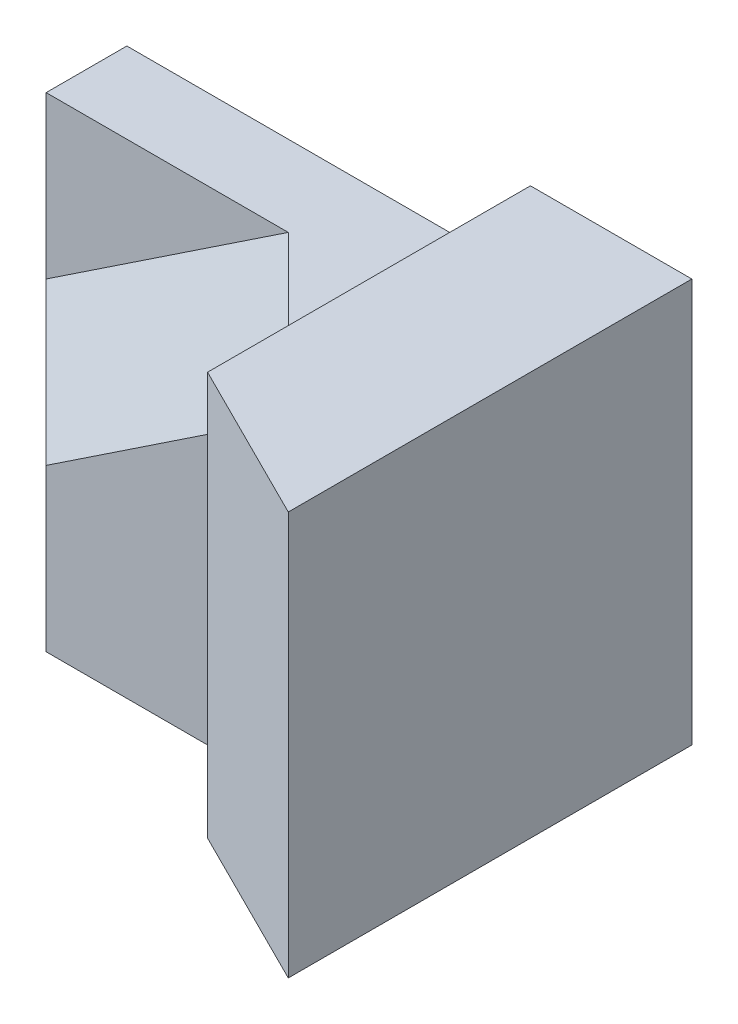
ISO-10303-21;
HEADER;
FILE_DESCRIPTION(('STEP AP214'),'2;1');
FILE_NAME('part.step','',(''),(''),'','','');
FILE_SCHEMA(('AUTOMOTIVE_DESIGN { 1 0 10303 214 1 1 1 1 }'));
ENDSEC;
DATA;
#1=APPLICATION_CONTEXT('core data for automotive mechanical design processes');
#2=APPLICATION_PROTOCOL_DEFINITION('international standard','automotive_design',2000,#1);
#3=PRODUCT_CONTEXT('',#1,'mechanical');
#4=PRODUCT('Part','Part','',(#3));
#5=PRODUCT_RELATED_PRODUCT_CATEGORY('part','',(#4));
#6=PRODUCT_DEFINITION_FORMATION('','',#4);
#7=PRODUCT_DEFINITION_CONTEXT('part definition',#1,'design');
#8=PRODUCT_DEFINITION('design','',#6,#7);
#9=PRODUCT_DEFINITION_SHAPE('','',#8);
#10=(LENGTH_UNIT() NAMED_UNIT(*) SI_UNIT(.MILLI.,.METRE.));
#11=(NAMED_UNIT(*) PLANE_ANGLE_UNIT() SI_UNIT($,.RADIAN.));
#12=(NAMED_UNIT(*) SI_UNIT($,.STERADIAN.) SOLID_ANGLE_UNIT());
#13=UNCERTAINTY_MEASURE_WITH_UNIT(LENGTH_MEASURE(1.E-05),#10,'distance_accuracy_value','');
#14=(GEOMETRIC_REPRESENTATION_CONTEXT(3) GLOBAL_UNCERTAINTY_ASSIGNED_CONTEXT((#13)) GLOBAL_UNIT_ASSIGNED_CONTEXT((#10,
#11,#12)) REPRESENTATION_CONTEXT('',''));
#15=CARTESIAN_POINT('',(0.,0.,0.));
#16=DIRECTION('',(0.,0.,1.));
#17=DIRECTION('',(1.,0.,0.));
#18=AXIS2_PLACEMENT_3D('',#15,#16,#17);
#19=CARTESIAN_POINT('',(0.,0.,10.));
#20=DIRECTION('',(0.,0.,1.));
#21=DIRECTION('',(1.,0.,0.));
#22=AXIS2_PLACEMENT_3D('',#19,#20,#21);
#23=PLANE('',#22);
#24=DIRECTION('',(1.,0.,0.));
#25=VECTOR('',#24,1.);
#26=CARTESIAN_POINT('',(0.,20.,10.));
#27=LINE('',#26,#25);
#28=CARTESIAN_POINT('',(0.,20.,10.));
#29=VERTEX_POINT('',#28);
#30=CARTESIAN_POINT('',(20.,20.,10.));
#31=VERTEX_POINT('',#30);
#32=EDGE_CURVE('E201',#29,#31,#27,.T.);
#33=ORIENTED_EDGE('',*,*,#32,.F.);
#34=DIRECTION('',(0.,-1.,0.));
#35=VECTOR('',#34,1.);
#36=CARTESIAN_POINT('',(0.,40.,10.));
#37=LINE('',#36,#35);
#38=CARTESIAN_POINT('',(0.,0.,10.));
#39=VERTEX_POINT('',#38);
#40=EDGE_CURVE('E152',#29,#39,#37,.T.);
#41=ORIENTED_EDGE('',*,*,#40,.T.);
#42=DIRECTION('',(1.,0.,0.));
#43=VECTOR('',#42,1.);
#44=CARTESIAN_POINT('',(0.,0.,10.));
#45=LINE('',#44,#43);
#46=CARTESIAN_POINT('',(20.,0.,10.));
#47=VERTEX_POINT('',#46);
#48=EDGE_CURVE('E157',#39,#47,#45,.T.);
#49=ORIENTED_EDGE('',*,*,#48,.T.);
#50=DIRECTION('',(0.,-1.,0.));
#51=VECTOR('',#50,1.);
#52=CARTESIAN_POINT('',(20.,19.99999999975,10.));
#53=LINE('',#52,#51);
#54=EDGE_CURVE('E182',#31,#47,#53,.T.);
#55=ORIENTED_EDGE('',*,*,#54,.F.);
#56=EDGE_LOOP('',(#33,#41,#49,#55));
#57=FACE_BOUND('',#56,.T.);
#58=ADVANCED_FACE('F33',(#57),#23,.T.);
#59=CARTESIAN_POINT('',(50.,50.,0.));
#60=DIRECTION('',(1.,0.,0.));
#61=DIRECTION('',(0.,0.,-1.));
#62=AXIS2_PLACEMENT_3D('',#59,#60,#61);
#63=PLANE('',#62);
#64=DIRECTION('',(0.,0.,1.));
#65=VECTOR('',#64,1.);
#66=CARTESIAN_POINT('',(50.,0.,10.));
#67=LINE('',#66,#65);
#68=CARTESIAN_POINT('',(50.,0.,30.));
#69=VERTEX_POINT('',#68);
#70=CARTESIAN_POINT('',(50.,0.,40.));
#71=VERTEX_POINT('',#70);
#72=EDGE_CURVE('E122',#69,#71,#67,.T.);
#73=ORIENTED_EDGE('',*,*,#72,.T.);
#74=DIRECTION('',(0.,1.,0.));
#75=VECTOR('',#74,1.);
#76=CARTESIAN_POINT('',(50.,-18.,40.));
#77=LINE('',#76,#75);
#78=CARTESIAN_POINT('',(50.,50.,40.));
#79=VERTEX_POINT('',#78);
#80=EDGE_CURVE('E132',#71,#79,#77,.T.);
#81=ORIENTED_EDGE('',*,*,#80,.T.);
#82=DIRECTION('',(0.,0.,1.));
#83=VECTOR('',#82,1.);
#84=CARTESIAN_POINT('',(50.,50.,0.));
#85=LINE('',#84,#83);
#86=CARTESIAN_POINT('',(50.,50.,0.));
#87=VERTEX_POINT('',#86);
#88=EDGE_CURVE('E131',#87,#79,#85,.T.);
#89=ORIENTED_EDGE('',*,*,#88,.F.);
#90=DIRECTION('',(0.,1.,0.));
#91=VECTOR('',#90,1.);
#92=CARTESIAN_POINT('',(50.,50.,0.));
#93=LINE('',#92,#91);
#94=CARTESIAN_POINT('',(50.,40.,0.));
#95=VERTEX_POINT('',#94);
#96=EDGE_CURVE('E149',#95,#87,#93,.T.);
#97=ORIENTED_EDGE('',*,*,#96,.F.);
#98=DIRECTION('',(0.,0.,-1.));
#99=VECTOR('',#98,1.);
#100=CARTESIAN_POINT('',(50.,40.,10.));
#101=LINE('',#100,#99);
#102=CARTESIAN_POINT('',(50.,40.,30.));
#103=VERTEX_POINT('',#102);
#104=EDGE_CURVE('E156',#103,#95,#101,.T.);
#105=ORIENTED_EDGE('',*,*,#104,.F.);
#106=DIRECTION('',(0.,1.,0.));
#107=VECTOR('',#106,1.);
#108=CARTESIAN_POINT('',(50.,0.,30.));
#109=LINE('',#108,#107);
#110=EDGE_CURVE('E184',#69,#103,#109,.T.);
#111=ORIENTED_EDGE('',*,*,#110,.F.);
#112=EDGE_LOOP('',(#73,#81,#89,#97,#105,#111));
#113=FACE_BOUND('',#112,.T.);
#114=ADVANCED_FACE('F209',(#113),#63,.F.);
#115=CARTESIAN_POINT('',(0.,0.,50.));
#116=DIRECTION('',(0.,1.,0.));
#117=DIRECTION('',(0.,0.,1.));
#118=AXIS2_PLACEMENT_3D('',#115,#116,#117);
#119=PLANE('',#118);
#120=DIRECTION('',(0.,0.,-1.));
#121=VECTOR('',#120,1.);
#122=CARTESIAN_POINT('',(70.,0.,50.));
#123=LINE('',#122,#121);
#124=CARTESIAN_POINT('',(70.,0.,50.));
#125=VERTEX_POINT('',#124);
#126=CARTESIAN_POINT('',(70.,0.,0.));
#127=VERTEX_POINT('',#126);
#128=EDGE_CURVE('E142',#125,#127,#123,.T.);
#129=ORIENTED_EDGE('',*,*,#128,.F.);
#130=DIRECTION('',(-0.894427190999916,0.,-0.447213595499958));
#131=VECTOR('',#130,1.);
#132=CARTESIAN_POINT('',(14.,0.,22.));
#133=LINE('',#132,#131);
#134=EDGE_CURVE('E117',#125,#71,#133,.T.);
#135=ORIENTED_EDGE('',*,*,#134,.T.);
#136=ORIENTED_EDGE('',*,*,#72,.F.);
#137=DIRECTION('',(1.,0.,0.));
#138=VECTOR('',#137,1.);
#139=CARTESIAN_POINT('',(20.,0.,30.));
#140=LINE('',#139,#138);
#141=CARTESIAN_POINT('',(20.,0.,30.));
#142=VERTEX_POINT('',#141);
#143=EDGE_CURVE('E181',#142,#69,#140,.T.);
#144=ORIENTED_EDGE('',*,*,#143,.F.);
#145=DIRECTION('',(0.,0.,-1.));
#146=VECTOR('',#145,1.);
#147=CARTESIAN_POINT('',(20.,0.,30.));
#148=LINE('',#147,#146);
#149=EDGE_CURVE('E153',#142,#47,#148,.T.);
#150=ORIENTED_EDGE('',*,*,#149,.T.);
#151=ORIENTED_EDGE('',*,*,#48,.F.);
#152=DIRECTION('',(0.,0.,-1.));
#153=VECTOR('',#152,1.);
#154=CARTESIAN_POINT('',(0.,0.,50.));
#155=LINE('',#154,#153);
#156=CARTESIAN_POINT('',(0.,0.,0.));
#157=VERTEX_POINT('',#156);
#158=EDGE_CURVE('E147',#39,#157,#155,.T.);
#159=ORIENTED_EDGE('',*,*,#158,.T.);
#160=DIRECTION('',(1.,0.,0.));
#161=VECTOR('',#160,1.);
#162=CARTESIAN_POINT('',(0.,0.,0.));
#163=LINE('',#162,#161);
#164=EDGE_CURVE('E146',#157,#127,#163,.T.);
#165=ORIENTED_EDGE('',*,*,#164,.T.);
#166=EDGE_LOOP('',(#129,#135,#136,#144,#150,#151,#159,#165));
#167=FACE_BOUND('',#166,.T.);
#168=ADVANCED_FACE('F176',(#167),#119,.F.);
#169=CARTESIAN_POINT('',(70.,0.,50.));
#170=DIRECTION('',(-1.,0.,0.));
#171=DIRECTION('',(0.,0.,1.));
#172=AXIS2_PLACEMENT_3D('',#169,#170,#171);
#173=PLANE('',#172);
#174=DIRECTION('',(0.,1.,0.));
#175=VECTOR('',#174,1.);
#176=CARTESIAN_POINT('',(70.,0.,0.));
#177=LINE('',#176,#175);
#178=CARTESIAN_POINT('',(70.,50.,0.));
#179=VERTEX_POINT('',#178);
#180=EDGE_CURVE('E136',#127,#179,#177,.T.);
#181=ORIENTED_EDGE('',*,*,#180,.T.);
#182=DIRECTION('',(0.,0.,-1.));
#183=VECTOR('',#182,1.);
#184=CARTESIAN_POINT('',(70.,50.,50.));
#185=LINE('',#184,#183);
#186=CARTESIAN_POINT('',(70.,50.,50.));
#187=VERTEX_POINT('',#186);
#188=EDGE_CURVE('E123',#187,#179,#185,.T.);
#189=ORIENTED_EDGE('',*,*,#188,.F.);
#190=DIRECTION('',(0.,1.,0.));
#191=VECTOR('',#190,1.);
#192=CARTESIAN_POINT('',(70.,0.,50.));
#193=LINE('',#192,#191);
#194=EDGE_CURVE('E111',#125,#187,#193,.T.);
#195=ORIENTED_EDGE('',*,*,#194,.F.);
#196=ORIENTED_EDGE('',*,*,#128,.T.);
#197=EDGE_LOOP('',(#181,#189,#195,#196));
#198=FACE_BOUND('',#197,.T.);
#199=ADVANCED_FACE('F134',(#198),#173,.F.);
#200=CARTESIAN_POINT('',(0.,50.,50.));
#201=DIRECTION('',(0.,-1.,0.));
#202=DIRECTION('',(0.,0.,-1.));
#203=AXIS2_PLACEMENT_3D('',#200,#201,#202);
#204=PLANE('',#203);
#205=ORIENTED_EDGE('',*,*,#88,.T.);
#206=DIRECTION('',(-0.894427190999916,0.,-0.447213595499958));
#207=VECTOR('',#206,1.);
#208=CARTESIAN_POINT('',(70.,50.,50.));
#209=LINE('',#208,#207);
#210=EDGE_CURVE('E114',#187,#79,#209,.T.);
#211=ORIENTED_EDGE('',*,*,#210,.F.);
#212=ORIENTED_EDGE('',*,*,#188,.T.);
#213=DIRECTION('',(-1.,0.,0.));
#214=VECTOR('',#213,1.);
#215=CARTESIAN_POINT('',(0.,50.,0.));
#216=LINE('',#215,#214);
#217=EDGE_CURVE('E138',#179,#87,#216,.T.);
#218=ORIENTED_EDGE('',*,*,#217,.T.);
#219=EDGE_LOOP('',(#205,#211,#212,#218));
#220=FACE_BOUND('',#219,.T.);
#221=ADVANCED_FACE('F128',(#220),#204,.F.);
#222=CARTESIAN_POINT('',(20.,19.99999999975,30.));
#223=DIRECTION('',(1.,0.,0.));
#224=DIRECTION('',(0.,0.,-1.));
#225=AXIS2_PLACEMENT_3D('',#222,#223,#224);
#226=PLANE('',#225);
#227=DIRECTION('',(0.,-1.,0.));
#228=VECTOR('',#227,1.);
#229=CARTESIAN_POINT('',(20.,19.99999999975,30.));
#230=LINE('',#229,#228);
#231=CARTESIAN_POINT('',(20.,19.99999999975,30.));
#232=VERTEX_POINT('',#231);
#233=EDGE_CURVE('E187',#232,#142,#230,.T.);
#234=ORIENTED_EDGE('',*,*,#233,.F.);
#235=DIRECTION('',(0.,0.,-1.));
#236=VECTOR('',#235,1.);
#237=CARTESIAN_POINT('',(20.,20.,30.));
#238=LINE('',#237,#236);
#239=EDGE_CURVE('E204',#232,#31,#238,.T.);
#240=ORIENTED_EDGE('',*,*,#239,.T.);
#241=ORIENTED_EDGE('',*,*,#54,.T.);
#242=ORIENTED_EDGE('',*,*,#149,.F.);
#243=EDGE_LOOP('',(#234,#240,#241,#242));
#244=FACE_BOUND('',#243,.T.);
#245=ADVANCED_FACE('F222',(#244),#226,.F.);
#246=CARTESIAN_POINT('',(0.,0.,30.));
#247=DIRECTION('',(0.,0.,-1.));
#248=DIRECTION('',(-1.,0.,0.));
#249=AXIS2_PLACEMENT_3D('',#246,#247,#248);
#250=PLANE('',#249);
#251=ORIENTED_EDGE('',*,*,#110,.T.);
#252=DIRECTION('',(-0.832050294334644,-0.554700196230029,0.));
#253=VECTOR('',#252,1.);
#254=CARTESIAN_POINT('',(50.,40.,30.));
#255=LINE('',#254,#253);
#256=EDGE_CURVE('E189',#103,#232,#255,.T.);
#257=ORIENTED_EDGE('',*,*,#256,.T.);
#258=ORIENTED_EDGE('',*,*,#233,.T.);
#259=ORIENTED_EDGE('',*,*,#143,.T.);
#260=EDGE_LOOP('',(#251,#257,#258,#259));
#261=FACE_BOUND('',#260,.T.);
#262=ADVANCED_FACE('F215',(#261),#250,.F.);
#263=CARTESIAN_POINT('',(-9.41176470583046,14.1176470585692,9.41176470583046));
#264=DIRECTION('',(0.485071250075876,-0.727606875104719,-0.485071250075876));
#265=DIRECTION('',(0.,0.55470019623003,-0.832050294334644));
#266=AXIS2_PLACEMENT_3D('',#263,#264,#265);
#267=PLANE('',#266);
#268=DIRECTION('',(-0.832050294334644,-0.554700196230029,0.));
#269=VECTOR('',#268,1.);
#270=CARTESIAN_POINT('',(0.,19.99999999975,10.));
#271=LINE('',#270,#269);
#272=CARTESIAN_POINT('',(30.,40.,10.));
#273=VERTEX_POINT('',#272);
#274=EDGE_CURVE('E198',#273,#29,#271,.T.);
#275=ORIENTED_EDGE('',*,*,#274,.T.);
#276=DIRECTION('',(0.707106781186547,0.,0.707106781186548));
#277=VECTOR('',#276,1.);
#278=CARTESIAN_POINT('',(20.,19.99999999975,30.));
#279=LINE('',#278,#277);
#280=EDGE_CURVE('E195',#29,#232,#279,.T.);
#281=ORIENTED_EDGE('',*,*,#280,.T.);
#282=ORIENTED_EDGE('',*,*,#256,.F.);
#283=DIRECTION('',(-0.707106781186548,0.,-0.707106781186548));
#284=VECTOR('',#283,1.);
#285=CARTESIAN_POINT('',(30.,40.,10.));
#286=LINE('',#285,#284);
#287=EDGE_CURVE('E185',#103,#273,#286,.T.);
#288=ORIENTED_EDGE('',*,*,#287,.T.);
#289=EDGE_LOOP('',(#275,#281,#282,#288));
#290=FACE_BOUND('',#289,.T.);
#291=ADVANCED_FACE('F220',(#290),#267,.F.);
#292=CARTESIAN_POINT('',(0.,20.,30.));
#293=DIRECTION('',(0.,-1.,0.));
#294=DIRECTION('',(0.,0.,-1.));
#295=AXIS2_PLACEMENT_3D('',#292,#293,#294);
#296=PLANE('',#295);
#297=ORIENTED_EDGE('',*,*,#280,.F.);
#298=ORIENTED_EDGE('',*,*,#32,.T.);
#299=ORIENTED_EDGE('',*,*,#239,.F.);
#300=EDGE_LOOP('',(#297,#298,#299));
#301=FACE_BOUND('',#300,.T.);
#302=ADVANCED_FACE('F227',(#301),#296,.T.);
#303=CARTESIAN_POINT('',(0.,0.,10.));
#304=DIRECTION('',(0.,0.,1.));
#305=DIRECTION('',(1.,0.,0.));
#306=AXIS2_PLACEMENT_3D('',#303,#304,#305);
#307=PLANE('',#306);
#308=DIRECTION('',(0.,-1.,0.));
#309=VECTOR('',#308,1.);
#310=CARTESIAN_POINT('',(0.,40.,10.));
#311=LINE('',#310,#309);
#312=CARTESIAN_POINT('',(0.,40.,10.));
#313=VERTEX_POINT('',#312);
#314=EDGE_CURVE('E162',#313,#29,#311,.T.);
#315=ORIENTED_EDGE('',*,*,#314,.T.);
#316=ORIENTED_EDGE('',*,*,#274,.F.);
#317=DIRECTION('',(-1.,0.,0.));
#318=VECTOR('',#317,1.);
#319=CARTESIAN_POINT('',(0.,40.,10.));
#320=LINE('',#319,#318);
#321=EDGE_CURVE('E56',#273,#313,#320,.T.);
#322=ORIENTED_EDGE('',*,*,#321,.T.);
#323=EDGE_LOOP('',(#315,#316,#322));
#324=FACE_BOUND('',#323,.T.);
#325=ADVANCED_FACE('F225',(#324),#307,.T.);
#326=CARTESIAN_POINT('',(0.,0.,0.));
#327=DIRECTION('',(0.,0.,-1.));
#328=DIRECTION('',(-1.,0.,0.));
#329=AXIS2_PLACEMENT_3D('',#326,#327,#328);
#330=PLANE('',#329);
#331=ORIENTED_EDGE('',*,*,#164,.F.);
#332=DIRECTION('',(0.,-1.,0.));
#333=VECTOR('',#332,1.);
#334=CARTESIAN_POINT('',(0.,0.,0.));
#335=LINE('',#334,#333);
#336=CARTESIAN_POINT('',(0.,40.,0.));
#337=VERTEX_POINT('',#336);
#338=EDGE_CURVE('E11',#337,#157,#335,.T.);
#339=ORIENTED_EDGE('',*,*,#338,.F.);
#340=DIRECTION('',(1.,0.,0.));
#341=VECTOR('',#340,1.);
#342=CARTESIAN_POINT('',(0.,40.,0.));
#343=LINE('',#342,#341);
#344=EDGE_CURVE('E48',#337,#95,#343,.T.);
#345=ORIENTED_EDGE('',*,*,#344,.T.);
#346=ORIENTED_EDGE('',*,*,#96,.T.);
#347=ORIENTED_EDGE('',*,*,#217,.F.);
#348=ORIENTED_EDGE('',*,*,#180,.F.);
#349=EDGE_LOOP('',(#331,#339,#345,#346,#347,#348));
#350=FACE_BOUND('',#349,.T.);
#351=ADVANCED_FACE('F174',(#350),#330,.T.);
#352=CARTESIAN_POINT('',(0.,40.,0.));
#353=DIRECTION('',(0.,-1.,0.));
#354=DIRECTION('',(0.,0.,-1.));
#355=AXIS2_PLACEMENT_3D('',#352,#353,#354);
#356=PLANE('',#355);
#357=ORIENTED_EDGE('',*,*,#321,.F.);
#358=ORIENTED_EDGE('',*,*,#287,.F.);
#359=ORIENTED_EDGE('',*,*,#104,.T.);
#360=ORIENTED_EDGE('',*,*,#344,.F.);
#361=DIRECTION('',(0.,0.,1.));
#362=VECTOR('',#361,1.);
#363=CARTESIAN_POINT('',(0.,40.,0.));
#364=LINE('',#363,#362);
#365=EDGE_CURVE('E41',#337,#313,#364,.T.);
#366=ORIENTED_EDGE('',*,*,#365,.T.);
#367=EDGE_LOOP('',(#357,#358,#359,#360,#366));
#368=FACE_BOUND('',#367,.T.);
#369=ADVANCED_FACE('F165',(#368),#356,.F.);
#370=CARTESIAN_POINT('',(0.,0.,50.));
#371=DIRECTION('',(1.,0.,0.));
#372=DIRECTION('',(0.,0.,-1.));
#373=AXIS2_PLACEMENT_3D('',#370,#371,#372);
#374=PLANE('',#373);
#375=ORIENTED_EDGE('',*,*,#338,.T.);
#376=ORIENTED_EDGE('',*,*,#158,.F.);
#377=ORIENTED_EDGE('',*,*,#40,.F.);
#378=ORIENTED_EDGE('',*,*,#314,.F.);
#379=ORIENTED_EDGE('',*,*,#365,.F.);
#380=EDGE_LOOP('',(#375,#376,#377,#378,#379));
#381=FACE_BOUND('',#380,.T.);
#382=ADVANCED_FACE('F35',(#381),#374,.F.);
#383=CARTESIAN_POINT('',(70.,-18.,50.));
#384=DIRECTION('',(0.447213595499958,0.,-0.894427190999916));
#385=DIRECTION('',(-0.894427190999916,0.,-0.447213595499958));
#386=AXIS2_PLACEMENT_3D('',#383,#384,#385);
#387=PLANE('',#386);
#388=ORIENTED_EDGE('',*,*,#194,.T.);
#389=ORIENTED_EDGE('',*,*,#210,.T.);
#390=ORIENTED_EDGE('',*,*,#80,.F.);
#391=ORIENTED_EDGE('',*,*,#134,.F.);
#392=EDGE_LOOP('',(#388,#389,#390,#391));
#393=FACE_BOUND('',#392,.T.);
#394=ADVANCED_FACE('F113',(#393),#387,.F.);
#395=CLOSED_SHELL('',(#58,#114,#168,#199,#221,#245,#262,#291,#302,#325,#351,#369,#382,#394));
#396=MANIFOLD_SOLID_BREP('B2',#395);
#397=ADVANCED_BREP_SHAPE_REPRESENTATION('',(#18,#396),#14);
#398=SHAPE_DEFINITION_REPRESENTATION(#9,#397);
ENDSEC;
END-ISO-10303-21;
